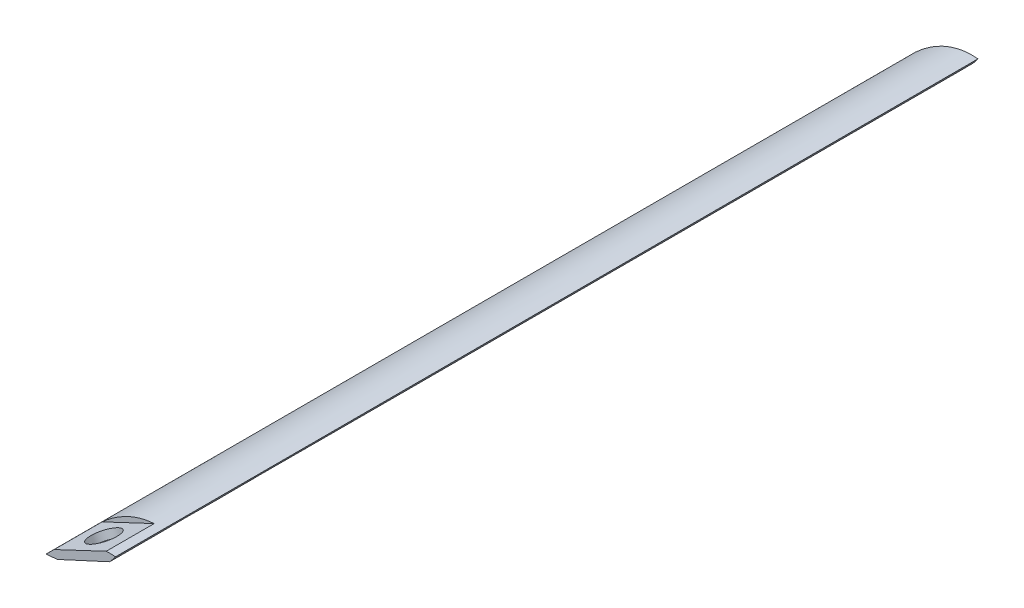
ISO-10303-21;
HEADER;
FILE_DESCRIPTION(('STEP AP214'),'2;1');
FILE_NAME('part.step','',(''),(''),'','','');
FILE_SCHEMA(('AUTOMOTIVE_DESIGN { 1 0 10303 214 1 1 1 1 }'));
ENDSEC;
DATA;
#1=APPLICATION_CONTEXT('core data for automotive mechanical design processes');
#2=APPLICATION_PROTOCOL_DEFINITION('international standard','automotive_design',2000,#1);
#3=PRODUCT_CONTEXT('',#1,'mechanical');
#4=PRODUCT('Part','Part','',(#3));
#5=PRODUCT_RELATED_PRODUCT_CATEGORY('part','',(#4));
#6=PRODUCT_DEFINITION_FORMATION('','',#4);
#7=PRODUCT_DEFINITION_CONTEXT('part definition',#1,'design');
#8=PRODUCT_DEFINITION('design','',#6,#7);
#9=PRODUCT_DEFINITION_SHAPE('','',#8);
#10=(LENGTH_UNIT() NAMED_UNIT(*) SI_UNIT(.MILLI.,.METRE.));
#11=(NAMED_UNIT(*) PLANE_ANGLE_UNIT() SI_UNIT($,.RADIAN.));
#12=(NAMED_UNIT(*) SI_UNIT($,.STERADIAN.) SOLID_ANGLE_UNIT());
#13=UNCERTAINTY_MEASURE_WITH_UNIT(LENGTH_MEASURE(1.E-05),#10,'distance_accuracy_value','');
#14=(GEOMETRIC_REPRESENTATION_CONTEXT(3) GLOBAL_UNCERTAINTY_ASSIGNED_CONTEXT((#13)) GLOBAL_UNIT_ASSIGNED_CONTEXT((#10,
#11,#12)) REPRESENTATION_CONTEXT('',''));
#15=CARTESIAN_POINT('',(0.,0.,0.));
#16=DIRECTION('',(0.,0.,1.));
#17=DIRECTION('',(1.,0.,0.));
#18=AXIS2_PLACEMENT_3D('',#15,#16,#17);
#19=CARTESIAN_POINT('',(0.,0.,90.));
#20=CARTESIAN_POINT('',(2.67512503080358,0.134281361601768,90.));
#21=CARTESIAN_POINT('',(5.66054125700676,1.05569706736828,90.));
#22=CARTESIAN_POINT('',(7.2502997146328,3.38129472953712,90.));
#23=B_SPLINE_CURVE_WITH_KNOTS('',3,(#19,#20,#21,#22),.UNSPECIFIED.,.F.,.F.,(4,4),(0.,1.),.UNSPECIFIED.);
#24=DIRECTION('',(0.,0.,-1.));
#25=VECTOR('',#24,1.);
#26=SURFACE_OF_LINEAR_EXTRUSION('',#23,#25);
#27=DIRECTION('',(0.,0.,1.));
#28=VECTOR('',#27,1.);
#29=CARTESIAN_POINT('',(1.18651252185036,0.111109172779712,85.));
#30=LINE('',#29,#28);
#31=CARTESIAN_POINT('',(1.18651252185036,0.111109172779712,85.));
#32=VERTEX_POINT('',#31);
#33=CARTESIAN_POINT('',(1.18651252185036,0.111109172779712,90.));
#34=VERTEX_POINT('',#33);
#35=EDGE_CURVE('E95',#32,#34,#30,.T.);
#36=ORIENTED_EDGE('',*,*,#35,.T.);
#37=CARTESIAN_POINT('',(0.,0.,90.));
#38=VERTEX_POINT('',#37);
#39=EDGE_CURVE('E115',#38,#34,#23,.T.);
#40=ORIENTED_EDGE('',*,*,#39,.F.);
#41=DIRECTION('',(0.,0.,-1.));
#42=VECTOR('',#41,1.);
#43=CARTESIAN_POINT('',(0.,0.,90.));
#44=LINE('',#43,#42);
#45=CARTESIAN_POINT('',(0.,0.,0.));
#46=VERTEX_POINT('',#45);
#47=EDGE_CURVE('E131',#38,#46,#44,.T.);
#48=ORIENTED_EDGE('',*,*,#47,.T.);
#49=CARTESIAN_POINT('',(0.,0.,0.));
#50=CARTESIAN_POINT('',(2.67512503080358,0.134281361601768,0.));
#51=CARTESIAN_POINT('',(5.66054125700676,1.05569706736828,0.));
#52=CARTESIAN_POINT('',(7.2502997146328,3.38129472953712,0.));
#53=B_SPLINE_CURVE_WITH_KNOTS('',3,(#49,#50,#51,#52),.UNSPECIFIED.,.F.,.F.,(4,4),(0.,1.),.UNSPECIFIED.);
#54=CARTESIAN_POINT('',(7.2502997146328,3.38129472953712,0.));
#55=VERTEX_POINT('',#54);
#56=EDGE_CURVE('E132',#46,#55,#53,.T.);
#57=ORIENTED_EDGE('',*,*,#56,.T.);
#58=DIRECTION('',(0.,0.,-1.));
#59=VECTOR('',#58,1.);
#60=CARTESIAN_POINT('',(7.2502997146328,3.38129472953712,90.));
#61=LINE('',#60,#59);
#62=CARTESIAN_POINT('',(7.2502997146328,3.38129472953712,90.));
#63=VERTEX_POINT('',#62);
#64=EDGE_CURVE('E223',#63,#55,#61,.T.);
#65=ORIENTED_EDGE('',*,*,#64,.F.);
#66=CARTESIAN_POINT('',(6.64407289782698,2.62843661951281,90.));
#67=VERTEX_POINT('',#66);
#68=EDGE_CURVE('E100',#67,#63,#23,.T.);
#69=ORIENTED_EDGE('',*,*,#68,.F.);
#70=DIRECTION('',(0.,0.,1.));
#71=VECTOR('',#70,1.);
#72=CARTESIAN_POINT('',(6.64407289793829,2.62843661963108,85.));
#73=LINE('',#72,#71);
#74=CARTESIAN_POINT('',(6.64407289793829,2.62843661963108,85.));
#75=VERTEX_POINT('',#74);
#76=EDGE_CURVE('E50',#75,#67,#73,.T.);
#77=ORIENTED_EDGE('',*,*,#76,.F.);
#78=CARTESIAN_POINT('',(0.,0.,85.));
#79=CARTESIAN_POINT('',(2.67512503080358,0.134281361601768,85.));
#80=CARTESIAN_POINT('',(5.66054125700676,1.05569706736828,85.));
#81=CARTESIAN_POINT('',(7.2502997146328,3.38129472953712,85.));
#82=B_SPLINE_CURVE_WITH_KNOTS('',3,(#78,#79,#80,#81),.UNSPECIFIED.,.F.,.F.,(4,4),(0.,1.),.UNSPECIFIED.);
#83=EDGE_CURVE('E11',#75,#32,#82,.F.);
#84=ORIENTED_EDGE('',*,*,#83,.T.);
#85=EDGE_LOOP('',(#36,#40,#48,#57,#65,#69,#77,#84));
#86=FACE_BOUND('',#85,.T.);
#87=ADVANCED_FACE('F33',(#86),#26,.F.);
#88=CARTESIAN_POINT('',(4.03216232225798,0.868903752055907,90.));
#89=DIRECTION('',(0.,0.,-1.));
#90=DIRECTION('',(-1.,0.,0.));
#91=AXIS2_PLACEMENT_3D('',#88,#89,#90);
#92=PLANE('',#91);
#93=DIRECTION('',(0.908057269441515,0.418846028290133,0.));
#94=VECTOR('',#93,1.);
#95=CARTESIAN_POINT('',(6.64407289793829,2.62843661963108,90.));
#96=LINE('',#95,#94);
#97=EDGE_CURVE('E96',#34,#67,#96,.T.);
#98=ORIENTED_EDGE('',*,*,#97,.T.);
#99=ORIENTED_EDGE('',*,*,#68,.T.);
#100=CARTESIAN_POINT('',(7.2502997146328,3.38129472953712,90.));
#101=CARTESIAN_POINT('',(4.44688487961502,3.65806485560016,90.));
#102=CARTESIAN_POINT('',(1.82221392911424,1.96312552096078,90.));
#103=CARTESIAN_POINT('',(0.,0.,90.));
#104=B_SPLINE_CURVE_WITH_KNOTS('',3,(#100,#101,#102,#103),.UNSPECIFIED.,.F.,.F.,(4,4),(0.,1.),.UNSPECIFIED.);
#105=CARTESIAN_POINT('',(6.283899982801,3.40073297138858,90.));
#106=VERTEX_POINT('',#105);
#107=EDGE_CURVE('E122',#63,#106,#104,.T.);
#108=ORIENTED_EDGE('',*,*,#107,.T.);
#109=DIRECTION('',(0.904501624600438,0.426470176091094,0.));
#110=VECTOR('',#109,1.);
#111=CARTESIAN_POINT('',(6.283899982801,3.40073297138858,90.));
#112=LINE('',#111,#110);
#113=CARTESIAN_POINT('',(0.847709573015363,0.837583259641434,90.));
#114=VERTEX_POINT('',#113);
#115=EDGE_CURVE('E109',#114,#106,#112,.T.);
#116=ORIENTED_EDGE('',*,*,#115,.F.);
#117=EDGE_CURVE('E121',#114,#38,#104,.T.);
#118=ORIENTED_EDGE('',*,*,#117,.T.);
#119=ORIENTED_EDGE('',*,*,#39,.T.);
#120=EDGE_LOOP('',(#98,#99,#108,#116,#118,#119));
#121=FACE_BOUND('',#120,.T.);
#122=ADVANCED_FACE('F149',(#121),#92,.F.);
#123=CARTESIAN_POINT('',(4.92036538124663,-1.08660262219867,87.4064953822824));
#124=DIRECTION('',(-0.42266184119214,0.9062874643291,0.));
#125=DIRECTION('',(-0.9062874643291,-0.422661841192141,0.));
#126=AXIS2_PLACEMENT_3D('',#123,#124,#125);
#127=CYLINDRICAL_SURFACE('',#126,1.5);
#128=CARTESIAN_POINT('',(3.45063226412197,2.06485457157695,87.4064953822824));
#129=DIRECTION('',(0.426470176091094,-0.904501624600438,0.));
#130=DIRECTION('',(0.904501624600438,0.426470176091094,0.));
#131=AXIS2_PLACEMENT_3D('',#128,#129,#130);
#132=ELLIPSE('',#131,1.50001326959607,1.5);
#133=CARTESIAN_POINT('',(4.80739670339383,2.70456549480056,87.4064953822824));
#134=VERTEX_POINT('',#133);
#135=EDGE_CURVE('E114',#134,#134,#132,.F.);
#136=ORIENTED_EDGE('',*,*,#135,.T.);
#137=EDGE_LOOP('',(#136));
#138=FACE_BOUND('',#137,.T.);
#139=CARTESIAN_POINT('',(3.79966745051083,1.31644015796018,87.4064953822824));
#140=DIRECTION('',(0.418846028290134,-0.908057269441515,0.));
#141=DIRECTION('',(-0.908057269441515,-0.418846028290134,0.));
#142=AXIS2_PLACEMENT_3D('',#139,#140,#141);
#143=ELLIPSE('',#142,1.50001326959607,1.5);
#144=CARTESIAN_POINT('',(2.43756949679539,0.688165557607369,87.4064953822824));
#145=VERTEX_POINT('',#144);
#146=EDGE_CURVE('E102',#145,#145,#143,.F.);
#147=ORIENTED_EDGE('',*,*,#146,.F.);
#148=EDGE_LOOP('',(#147));
#149=FACE_BOUND('',#148,.T.);
#150=ADVANCED_FACE('F143',(#138,#149),#127,.F.);
#151=DIRECTION('',(0.,0.,-1.));
#152=VECTOR('',#151,1.);
#153=SURFACE_OF_LINEAR_EXTRUSION('',#104,#152);
#154=CARTESIAN_POINT('',(7.2502997146328,3.38129472953712,85.));
#155=CARTESIAN_POINT('',(4.44688487961502,3.65806485560016,85.));
#156=CARTESIAN_POINT('',(1.82221392911424,1.96312552096078,85.));
#157=CARTESIAN_POINT('',(0.,0.,85.));
#158=B_SPLINE_CURVE_WITH_KNOTS('',3,(#154,#155,#156,#157),.UNSPECIFIED.,.F.,.F.,(4,4),(0.,1.),.UNSPECIFIED.);
#159=CARTESIAN_POINT('',(0.847709565469128,0.83758325281469,85.));
#160=VERTEX_POINT('',#159);
#161=CARTESIAN_POINT('',(6.283899982801,3.40073297138858,85.));
#162=VERTEX_POINT('',#161);
#163=EDGE_CURVE('E43',#160,#162,#158,.F.);
#164=ORIENTED_EDGE('',*,*,#163,.T.);
#165=DIRECTION('',(0.,0.,1.));
#166=VECTOR('',#165,1.);
#167=CARTESIAN_POINT('',(6.283899982801,3.40073297138858,85.));
#168=LINE('',#167,#166);
#169=EDGE_CURVE('E111',#162,#106,#168,.T.);
#170=ORIENTED_EDGE('',*,*,#169,.T.);
#171=ORIENTED_EDGE('',*,*,#107,.F.);
#172=ORIENTED_EDGE('',*,*,#64,.T.);
#173=CARTESIAN_POINT('',(7.2502997146328,3.38129472953712,0.));
#174=CARTESIAN_POINT('',(4.44688487961502,3.65806485560016,0.));
#175=CARTESIAN_POINT('',(1.82221392911424,1.96312552096078,0.));
#176=CARTESIAN_POINT('',(0.,0.,0.));
#177=B_SPLINE_CURVE_WITH_KNOTS('',3,(#173,#174,#175,#176),.UNSPECIFIED.,.F.,.F.,(4,4),(0.,1.),.UNSPECIFIED.);
#178=EDGE_CURVE('E239',#55,#46,#177,.T.);
#179=ORIENTED_EDGE('',*,*,#178,.T.);
#180=ORIENTED_EDGE('',*,*,#47,.F.);
#181=ORIENTED_EDGE('',*,*,#117,.F.);
#182=DIRECTION('',(0.,0.,1.));
#183=VECTOR('',#182,1.);
#184=CARTESIAN_POINT('',(0.847709565469128,0.83758325281469,85.));
#185=LINE('',#184,#183);
#186=EDGE_CURVE('E58',#160,#114,#185,.T.);
#187=ORIENTED_EDGE('',*,*,#186,.F.);
#188=EDGE_LOOP('',(#164,#170,#171,#172,#179,#180,#181,#187));
#189=FACE_BOUND('',#188,.T.);
#190=ADVANCED_FACE('F139',(#189),#153,.F.);
#191=CARTESIAN_POINT('',(4.03216232225798,0.868903752055907,0.));
#192=DIRECTION('',(0.,0.,-1.));
#193=DIRECTION('',(-1.,0.,0.));
#194=AXIS2_PLACEMENT_3D('',#191,#192,#193);
#195=PLANE('',#194);
#196=ORIENTED_EDGE('',*,*,#56,.F.);
#197=ORIENTED_EDGE('',*,*,#178,.F.);
#198=EDGE_LOOP('',(#196,#197));
#199=FACE_BOUND('',#198,.T.);
#200=ADVANCED_FACE('F142',(#199),#195,.T.);
#201=CARTESIAN_POINT('',(0.,0.,85.));
#202=DIRECTION('',(0.,0.,-1.));
#203=DIRECTION('',(-1.,0.,0.));
#204=AXIS2_PLACEMENT_3D('',#201,#202,#203);
#205=PLANE('',#204);
#206=DIRECTION('',(0.904501624600438,0.426470176091094,0.));
#207=VECTOR('',#206,1.);
#208=CARTESIAN_POINT('',(6.283899982801,3.40073297138858,85.));
#209=LINE('',#208,#207);
#210=EDGE_CURVE('E106',#160,#162,#209,.T.);
#211=ORIENTED_EDGE('',*,*,#210,.T.);
#212=ORIENTED_EDGE('',*,*,#163,.F.);
#213=EDGE_LOOP('',(#211,#212));
#214=FACE_BOUND('',#213,.T.);
#215=ADVANCED_FACE('F147',(#214),#205,.F.);
#216=CARTESIAN_POINT('',(6.283899982801,3.40073297138858,85.));
#217=DIRECTION('',(0.426470176091094,-0.904501624600438,0.));
#218=DIRECTION('',(0.904501624600438,0.426470176091094,0.));
#219=AXIS2_PLACEMENT_3D('',#216,#217,#218);
#220=PLANE('',#219);
#221=ORIENTED_EDGE('',*,*,#115,.T.);
#222=ORIENTED_EDGE('',*,*,#169,.F.);
#223=ORIENTED_EDGE('',*,*,#210,.F.);
#224=ORIENTED_EDGE('',*,*,#186,.T.);
#225=EDGE_LOOP('',(#221,#222,#223,#224));
#226=FACE_BOUND('',#225,.T.);
#227=ORIENTED_EDGE('',*,*,#135,.F.);
#228=EDGE_LOOP('',(#227));
#229=FACE_BOUND('',#228,.T.);
#230=ADVANCED_FACE('F156',(#226,#229),#220,.F.);
#231=CARTESIAN_POINT('',(0.,0.,85.));
#232=DIRECTION('',(0.,0.,-1.));
#233=DIRECTION('',(-0.64271393600014,-0.766106256645388,0.));
#234=AXIS2_PLACEMENT_3D('',#231,#232,#233);
#235=PLANE('',#234);
#236=DIRECTION('',(0.908057269441515,0.418846028290133,0.));
#237=VECTOR('',#236,1.);
#238=CARTESIAN_POINT('',(6.64407289793829,2.62843661963108,85.));
#239=LINE('',#238,#237);
#240=EDGE_CURVE('E90',#32,#75,#239,.T.);
#241=ORIENTED_EDGE('',*,*,#240,.F.);
#242=ORIENTED_EDGE('',*,*,#83,.F.);
#243=EDGE_LOOP('',(#241,#242));
#244=FACE_BOUND('',#243,.T.);
#245=ADVANCED_FACE('F89',(#244),#235,.F.);
#246=CARTESIAN_POINT('',(6.64407289793829,2.62843661963108,85.));
#247=DIRECTION('',(0.418846028290134,-0.908057269441515,0.));
#248=DIRECTION('',(0.908057269441515,0.418846028290134,0.));
#249=AXIS2_PLACEMENT_3D('',#246,#247,#248);
#250=PLANE('',#249);
#251=ORIENTED_EDGE('',*,*,#97,.F.);
#252=ORIENTED_EDGE('',*,*,#35,.F.);
#253=ORIENTED_EDGE('',*,*,#240,.T.);
#254=ORIENTED_EDGE('',*,*,#76,.T.);
#255=EDGE_LOOP('',(#251,#252,#253,#254));
#256=FACE_BOUND('',#255,.T.);
#257=ORIENTED_EDGE('',*,*,#146,.T.);
#258=EDGE_LOOP('',(#257));
#259=FACE_BOUND('',#258,.T.);
#260=ADVANCED_FACE('F93',(#256,#259),#250,.T.);
#261=CLOSED_SHELL('',(#87,#122,#150,#190,#200,#215,#230,#245,#260));
#262=MANIFOLD_SOLID_BREP('B2',#261);
#263=ADVANCED_BREP_SHAPE_REPRESENTATION('',(#18,#262),#14);
#264=SHAPE_DEFINITION_REPRESENTATION(#9,#263);
ENDSEC;
END-ISO-10303-21;
